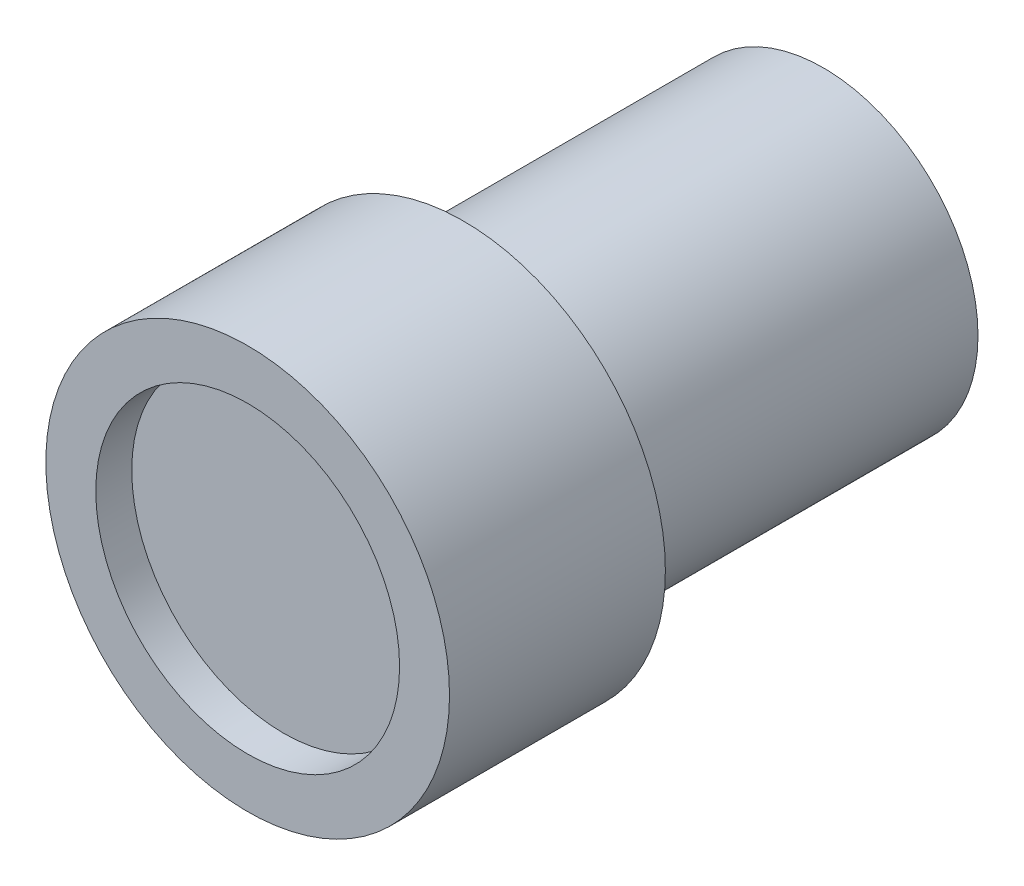
ISO-10303-21;
HEADER;
FILE_DESCRIPTION(('STEP AP214'),'2;1');
FILE_NAME('part.step','',(''),(''),'','','');
FILE_SCHEMA(('AUTOMOTIVE_DESIGN { 1 0 10303 214 1 1 1 1 }'));
ENDSEC;
DATA;
#1=APPLICATION_CONTEXT('core data for automotive mechanical design processes');
#2=APPLICATION_PROTOCOL_DEFINITION('international standard','automotive_design',2000,#1);
#3=PRODUCT_CONTEXT('',#1,'mechanical');
#4=PRODUCT('Part','Part','',(#3));
#5=PRODUCT_RELATED_PRODUCT_CATEGORY('part','',(#4));
#6=PRODUCT_DEFINITION_FORMATION('','',#4);
#7=PRODUCT_DEFINITION_CONTEXT('part definition',#1,'design');
#8=PRODUCT_DEFINITION('design','',#6,#7);
#9=PRODUCT_DEFINITION_SHAPE('','',#8);
#10=(LENGTH_UNIT() NAMED_UNIT(*) SI_UNIT(.MILLI.,.METRE.));
#11=(NAMED_UNIT(*) PLANE_ANGLE_UNIT() SI_UNIT($,.RADIAN.));
#12=(NAMED_UNIT(*) SI_UNIT($,.STERADIAN.) SOLID_ANGLE_UNIT());
#13=UNCERTAINTY_MEASURE_WITH_UNIT(LENGTH_MEASURE(1.E-05),#10,'distance_accuracy_value','');
#14=(GEOMETRIC_REPRESENTATION_CONTEXT(3) GLOBAL_UNCERTAINTY_ASSIGNED_CONTEXT((#13)) GLOBAL_UNIT_ASSIGNED_CONTEXT((#10,
#11,#12)) REPRESENTATION_CONTEXT('',''));
#15=CARTESIAN_POINT('',(0.,0.,0.));
#16=DIRECTION('',(0.,0.,1.));
#17=DIRECTION('',(1.,0.,0.));
#18=AXIS2_PLACEMENT_3D('',#15,#16,#17);
#19=CARTESIAN_POINT('',(0.,0.,12.7));
#20=DIRECTION('',(0.,0.,-1.));
#21=DIRECTION('',(-1.,0.,0.));
#22=AXIS2_PLACEMENT_3D('',#19,#20,#21);
#23=CYLINDRICAL_SURFACE('',#22,5.461);
#24=CARTESIAN_POINT('',(0.,0.,12.7));
#25=DIRECTION('',(0.,0.,1.));
#26=DIRECTION('',(1.,0.,0.));
#27=AXIS2_PLACEMENT_3D('',#24,#25,#26);
#28=CIRCLE('',#27,5.461);
#29=CARTESIAN_POINT('',(5.46099999999996,0.,12.7));
#30=VERTEX_POINT('',#29);
#31=EDGE_CURVE('E10',#30,#30,#28,.T.);
#32=ORIENTED_EDGE('',*,*,#31,.F.);
#33=EDGE_LOOP('',(#32));
#34=FACE_BOUND('',#33,.T.);
#35=CARTESIAN_POINT('',(0.,0.,1.11022302462516E-13));
#36=DIRECTION('',(0.,0.,1.));
#37=DIRECTION('',(1.,0.,0.));
#38=AXIS2_PLACEMENT_3D('',#35,#36,#37);
#39=CIRCLE('',#38,5.461);
#40=CARTESIAN_POINT('',(5.46100000000002,0.,1.11053571835728E-13));
#41=VERTEX_POINT('',#40);
#42=EDGE_CURVE('E39',#41,#41,#39,.T.);
#43=ORIENTED_EDGE('',*,*,#42,.T.);
#44=EDGE_LOOP('',(#43));
#45=FACE_BOUND('',#44,.T.);
#46=ADVANCED_FACE('F36',(#34,#45),#23,.T.);
#47=CARTESIAN_POINT('',(0.,0.,1.11022302462516E-13));
#48=DIRECTION('',(0.,0.,1.));
#49=DIRECTION('',(1.,0.,0.));
#50=AXIS2_PLACEMENT_3D('',#47,#48,#49);
#51=PLANE('',#50);
#52=ORIENTED_EDGE('',*,*,#42,.F.);
#53=EDGE_LOOP('',(#52));
#54=FACE_BOUND('',#53,.T.);
#55=ADVANCED_FACE('F82',(#54),#51,.F.);
#56=CARTESIAN_POINT('',(0.,0.,12.7));
#57=DIRECTION('',(0.,0.,1.));
#58=DIRECTION('',(1.,0.,0.));
#59=AXIS2_PLACEMENT_3D('',#56,#57,#58);
#60=PLANE('',#59);
#61=CARTESIAN_POINT('',(0.,0.,12.7));
#62=DIRECTION('',(0.,0.,1.));
#63=DIRECTION('',(1.,0.,0.));
#64=AXIS2_PLACEMENT_3D('',#61,#62,#63);
#65=CIRCLE('',#64,7.1250920688283);
#66=CARTESIAN_POINT('',(7.12509206882827,0.,12.7));
#67=VERTEX_POINT('',#66);
#68=EDGE_CURVE('E48',#67,#67,#65,.T.);
#69=ORIENTED_EDGE('',*,*,#68,.F.);
#70=EDGE_LOOP('',(#69));
#71=FACE_BOUND('',#70,.T.);
#72=ORIENTED_EDGE('',*,*,#31,.T.);
#73=EDGE_LOOP('',(#72));
#74=FACE_BOUND('',#73,.T.);
#75=ADVANCED_FACE('F77',(#71,#74),#60,.F.);
#76=CARTESIAN_POINT('',(0.,0.,20.32));
#77=DIRECTION('',(0.,0.,-1.));
#78=DIRECTION('',(-1.,0.,0.));
#79=AXIS2_PLACEMENT_3D('',#76,#77,#78);
#80=CYLINDRICAL_SURFACE('',#79,7.1250920688283);
#81=CARTESIAN_POINT('',(0.,0.,20.32));
#82=DIRECTION('',(0.,0.,1.));
#83=DIRECTION('',(1.,0.,0.));
#84=AXIS2_PLACEMENT_3D('',#81,#82,#83);
#85=CIRCLE('',#84,7.1250920688283);
#86=CARTESIAN_POINT('',(7.12509206882833,0.,20.32));
#87=VERTEX_POINT('',#86);
#88=EDGE_CURVE('E46',#87,#87,#85,.T.);
#89=ORIENTED_EDGE('',*,*,#88,.F.);
#90=EDGE_LOOP('',(#89));
#91=FACE_BOUND('',#90,.T.);
#92=ORIENTED_EDGE('',*,*,#68,.T.);
#93=EDGE_LOOP('',(#92));
#94=FACE_BOUND('',#93,.T.);
#95=ADVANCED_FACE('F71',(#91,#94),#80,.T.);
#96=CARTESIAN_POINT('',(0.,0.,20.32));
#97=DIRECTION('',(0.,0.,1.));
#98=DIRECTION('',(1.,0.,0.));
#99=AXIS2_PLACEMENT_3D('',#96,#97,#98);
#100=PLANE('',#99);
#101=CARTESIAN_POINT('',(0.,0.,20.32));
#102=DIRECTION('',(0.,0.,1.));
#103=DIRECTION('',(1.,0.,0.));
#104=AXIS2_PLACEMENT_3D('',#101,#102,#103);
#105=CIRCLE('',#104,5.36238377408318);
#106=CARTESIAN_POINT('',(5.3623837740832,0.,20.32));
#107=VERTEX_POINT('',#106);
#108=EDGE_CURVE('E54',#107,#107,#105,.T.);
#109=ORIENTED_EDGE('',*,*,#108,.F.);
#110=EDGE_LOOP('',(#109));
#111=FACE_BOUND('',#110,.T.);
#112=ORIENTED_EDGE('',*,*,#88,.T.);
#113=EDGE_LOOP('',(#112));
#114=FACE_BOUND('',#113,.T.);
#115=ADVANCED_FACE('F65',(#111,#114),#100,.T.);
#116=CARTESIAN_POINT('',(0.,0.,19.05));
#117=DIRECTION('',(0.,0.,1.));
#118=DIRECTION('',(1.,0.,0.));
#119=AXIS2_PLACEMENT_3D('',#116,#117,#118);
#120=CYLINDRICAL_SURFACE('',#119,5.36238377408318);
#121=CARTESIAN_POINT('',(0.,0.,19.05));
#122=DIRECTION('',(0.,0.,1.));
#123=DIRECTION('',(1.,0.,0.));
#124=AXIS2_PLACEMENT_3D('',#121,#122,#123);
#125=CIRCLE('',#124,5.36238377408318);
#126=CARTESIAN_POINT('',(5.3623837740832,0.,19.05));
#127=VERTEX_POINT('',#126);
#128=EDGE_CURVE('E51',#127,#127,#125,.T.);
#129=ORIENTED_EDGE('',*,*,#128,.F.);
#130=EDGE_LOOP('',(#129));
#131=FACE_BOUND('',#130,.T.);
#132=ORIENTED_EDGE('',*,*,#108,.T.);
#133=EDGE_LOOP('',(#132));
#134=FACE_BOUND('',#133,.T.);
#135=ADVANCED_FACE('F62',(#131,#134),#120,.F.);
#136=CARTESIAN_POINT('',(0.,0.,19.05));
#137=DIRECTION('',(0.,0.,1.));
#138=DIRECTION('',(1.,0.,0.));
#139=AXIS2_PLACEMENT_3D('',#136,#137,#138);
#140=PLANE('',#139);
#141=ORIENTED_EDGE('',*,*,#128,.T.);
#142=EDGE_LOOP('',(#141));
#143=FACE_BOUND('',#142,.T.);
#144=ADVANCED_FACE('F60',(#143),#140,.T.);
#145=CLOSED_SHELL('',(#46,#55,#75,#95,#115,#135,#144));
#146=MANIFOLD_SOLID_BREP('B2',#145);
#147=ADVANCED_BREP_SHAPE_REPRESENTATION('',(#18,#146),#14);
#148=SHAPE_DEFINITION_REPRESENTATION(#9,#147);
ENDSEC;
END-ISO-10303-21;
